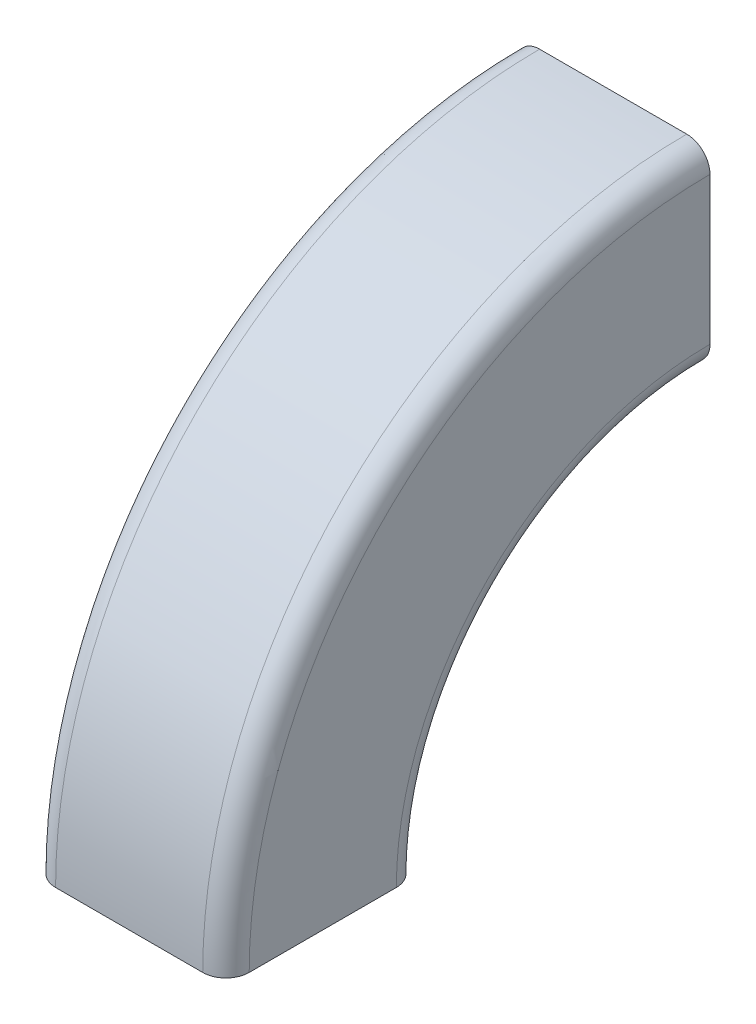
ISO-10303-21;
HEADER;
FILE_DESCRIPTION(('STEP AP214'),'2;1');
FILE_NAME('part.step','',(''),(''),'','','');
FILE_SCHEMA(('AUTOMOTIVE_DESIGN { 1 0 10303 214 1 1 1 1 }'));
ENDSEC;
DATA;
#1=APPLICATION_CONTEXT('core data for automotive mechanical design processes');
#2=APPLICATION_PROTOCOL_DEFINITION('international standard','automotive_design',2000,#1);
#3=PRODUCT_CONTEXT('',#1,'mechanical');
#4=PRODUCT('Part','Part','',(#3));
#5=PRODUCT_RELATED_PRODUCT_CATEGORY('part','',(#4));
#6=PRODUCT_DEFINITION_FORMATION('','',#4);
#7=PRODUCT_DEFINITION_CONTEXT('part definition',#1,'design');
#8=PRODUCT_DEFINITION('design','',#6,#7);
#9=PRODUCT_DEFINITION_SHAPE('','',#8);
#10=(LENGTH_UNIT() NAMED_UNIT(*) SI_UNIT(.MILLI.,.METRE.));
#11=(NAMED_UNIT(*) PLANE_ANGLE_UNIT() SI_UNIT($,.RADIAN.));
#12=(NAMED_UNIT(*) SI_UNIT($,.STERADIAN.) SOLID_ANGLE_UNIT());
#13=UNCERTAINTY_MEASURE_WITH_UNIT(LENGTH_MEASURE(1.E-05),#10,'distance_accuracy_value','');
#14=(GEOMETRIC_REPRESENTATION_CONTEXT(3) GLOBAL_UNCERTAINTY_ASSIGNED_CONTEXT((#13)) GLOBAL_UNIT_ASSIGNED_CONTEXT((#10,
#11,#12)) REPRESENTATION_CONTEXT('',''));
#15=CARTESIAN_POINT('',(0.,0.,0.));
#16=DIRECTION('',(0.,0.,1.));
#17=DIRECTION('',(1.,0.,0.));
#18=AXIS2_PLACEMENT_3D('',#15,#16,#17);
#19=CARTESIAN_POINT('',(0.,-49.9999999810388,50.));
#20=DIRECTION('',(0.,1.,-3.79222714511838E-10));
#21=DIRECTION('',(-0.999999999997454,0.,-2.25629999750851E-06));
#22=AXIS2_PLACEMENT_3D('',#19,#20,#21);
#23=PLANE('',#22);
#24=CARTESIAN_POINT('',(-9.5,-49.9999999846414,40.5));
#25=DIRECTION('',(0.,1.,-3.79222714511838E-10));
#26=DIRECTION('',(1.,0.,0.));
#27=AXIS2_PLACEMENT_3D('',#24,#25,#26);
#28=CIRCLE('',#27,3.);
#29=CARTESIAN_POINT('',(-9.5,-49.9999999857791,37.5));
#30=VERTEX_POINT('',#29);
#31=CARTESIAN_POINT('',(-12.5,-49.9999999846414,40.5));
#32=VERTEX_POINT('',#31);
#33=EDGE_CURVE('E26',#30,#32,#28,.T.);
#34=ORIENTED_EDGE('',*,*,#33,.F.);
#35=DIRECTION('',(-1.,0.,0.));
#36=VECTOR('',#35,1.);
#37=CARTESIAN_POINT('',(9.5,-49.9999999857791,37.5));
#38=LINE('',#37,#36);
#39=CARTESIAN_POINT('',(9.5,-49.9999999857791,37.5));
#40=VERTEX_POINT('',#39);
#41=EDGE_CURVE('E215',#40,#30,#38,.T.);
#42=ORIENTED_EDGE('',*,*,#41,.F.);
#43=CARTESIAN_POINT('',(9.5,-49.9999999846414,40.5));
#44=DIRECTION('',(0.,1.,-3.79222714511838E-10));
#45=DIRECTION('',(0.,3.79222714511838E-10,1.));
#46=AXIS2_PLACEMENT_3D('',#43,#44,#45);
#47=CIRCLE('',#46,3.);
#48=CARTESIAN_POINT('',(12.5,-49.9999999846414,40.5));
#49=VERTEX_POINT('',#48);
#50=EDGE_CURVE('E254',#49,#40,#47,.T.);
#51=ORIENTED_EDGE('',*,*,#50,.F.);
#52=DIRECTION('',(0.,-3.79222714511838E-10,-1.));
#53=VECTOR('',#52,1.);
#54=CARTESIAN_POINT('',(12.5,-49.9999999774362,59.5));
#55=LINE('',#54,#53);
#56=CARTESIAN_POINT('',(12.5,-49.9999999774362,59.5));
#57=VERTEX_POINT('',#56);
#58=EDGE_CURVE('E288',#57,#49,#55,.T.);
#59=ORIENTED_EDGE('',*,*,#58,.F.);
#60=CARTESIAN_POINT('',(9.5,-49.9999999774362,59.5));
#61=DIRECTION('',(0.,1.,-3.79222714511838E-10));
#62=DIRECTION('',(-1.,0.,0.));
#63=AXIS2_PLACEMENT_3D('',#60,#61,#62);
#64=CIRCLE('',#63,3.);
#65=CARTESIAN_POINT('',(9.5,-49.9999999762985,62.5));
#66=VERTEX_POINT('',#65);
#67=EDGE_CURVE('E188',#66,#57,#64,.T.);
#68=ORIENTED_EDGE('',*,*,#67,.F.);
#69=DIRECTION('',(1.,0.,0.));
#70=VECTOR('',#69,1.);
#71=CARTESIAN_POINT('',(-9.5,-49.9999999762985,62.5));
#72=LINE('',#71,#70);
#73=CARTESIAN_POINT('',(-9.5,-49.9999999762985,62.5));
#74=VERTEX_POINT('',#73);
#75=EDGE_CURVE('E181',#74,#66,#72,.T.);
#76=ORIENTED_EDGE('',*,*,#75,.F.);
#77=CARTESIAN_POINT('',(-9.5,-49.9999999774362,59.5));
#78=DIRECTION('',(0.,1.,-3.79222714511838E-10));
#79=DIRECTION('',(0.,-3.79222714511838E-10,-1.));
#80=AXIS2_PLACEMENT_3D('',#77,#78,#79);
#81=CIRCLE('',#80,3.);
#82=CARTESIAN_POINT('',(-12.5,-49.9999999774362,59.5));
#83=VERTEX_POINT('',#82);
#84=EDGE_CURVE('E165',#83,#74,#81,.T.);
#85=ORIENTED_EDGE('',*,*,#84,.F.);
#86=DIRECTION('',(0.,3.79222714511838E-10,1.));
#87=VECTOR('',#86,1.);
#88=CARTESIAN_POINT('',(-12.5,-49.9999999846414,40.5));
#89=LINE('',#88,#87);
#90=EDGE_CURVE('E151',#32,#83,#89,.T.);
#91=ORIENTED_EDGE('',*,*,#90,.F.);
#92=EDGE_LOOP('',(#34,#42,#51,#59,#68,#76,#85,#91));
#93=FACE_BOUND('',#92,.T.);
#94=DIRECTION('',(0.,3.79222714511838E-10,1.));
#95=VECTOR('',#94,1.);
#96=CARTESIAN_POINT('',(-10.5,-49.9999999828401,45.25));
#97=LINE('',#96,#95);
#98=CARTESIAN_POINT('',(-10.5,-49.9999999846414,40.5));
#99=VERTEX_POINT('',#98);
#100=CARTESIAN_POINT('',(-10.5,-49.9999999774362,59.5));
#101=VERTEX_POINT('',#100);
#102=EDGE_CURVE('E310',#99,#101,#97,.T.);
#103=ORIENTED_EDGE('',*,*,#102,.T.);
#104=CARTESIAN_POINT('',(-9.5,-49.9999999774362,59.5));
#105=DIRECTION('',(0.,1.,-3.79222714511838E-10));
#106=DIRECTION('',(0.,3.79222714511838E-10,1.));
#107=AXIS2_PLACEMENT_3D('',#104,#105,#106);
#108=CIRCLE('',#107,1.);
#109=CARTESIAN_POINT('',(-9.5,-49.999999977057,60.5));
#110=VERTEX_POINT('',#109);
#111=EDGE_CURVE('E208',#101,#110,#108,.T.);
#112=ORIENTED_EDGE('',*,*,#111,.T.);
#113=DIRECTION('',(1.,0.,0.));
#114=VECTOR('',#113,1.);
#115=CARTESIAN_POINT('',(0.,-49.999999977057,60.5));
#116=LINE('',#115,#114);
#117=CARTESIAN_POINT('',(9.5,-49.999999977057,60.5));
#118=VERTEX_POINT('',#117);
#119=EDGE_CURVE('E240',#110,#118,#116,.T.);
#120=ORIENTED_EDGE('',*,*,#119,.T.);
#121=CARTESIAN_POINT('',(9.5,-49.9999999774362,59.5));
#122=DIRECTION('',(0.,1.,-3.79222714511838E-10));
#123=DIRECTION('',(0.,3.79222714511838E-10,1.));
#124=AXIS2_PLACEMENT_3D('',#121,#122,#123);
#125=CIRCLE('',#124,1.);
#126=CARTESIAN_POINT('',(10.5,-49.9999999774362,59.5));
#127=VERTEX_POINT('',#126);
#128=EDGE_CURVE('E207',#118,#127,#125,.T.);
#129=ORIENTED_EDGE('',*,*,#128,.T.);
#130=DIRECTION('',(0.,-3.79222714511838E-10,-1.));
#131=VECTOR('',#130,1.);
#132=CARTESIAN_POINT('',(10.5,-49.9999999792375,54.75));
#133=LINE('',#132,#131);
#134=CARTESIAN_POINT('',(10.5,-49.9999999846414,40.5));
#135=VERTEX_POINT('',#134);
#136=EDGE_CURVE('E222',#127,#135,#133,.T.);
#137=ORIENTED_EDGE('',*,*,#136,.T.);
#138=CARTESIAN_POINT('',(9.5,-49.9999999846415,40.5));
#139=DIRECTION('',(0.,1.,-3.79222714511838E-10));
#140=DIRECTION('',(0.,3.79222714511838E-10,1.));
#141=AXIS2_PLACEMENT_3D('',#138,#139,#140);
#142=CIRCLE('',#141,1.);
#143=CARTESIAN_POINT('',(9.5,-49.9999999850207,39.5));
#144=VERTEX_POINT('',#143);
#145=EDGE_CURVE('E80',#135,#144,#142,.T.);
#146=ORIENTED_EDGE('',*,*,#145,.T.);
#147=DIRECTION('',(-1.,0.,0.));
#148=VECTOR('',#147,1.);
#149=CARTESIAN_POINT('',(0.,-49.9999999850207,39.5));
#150=LINE('',#149,#148);
#151=CARTESIAN_POINT('',(-9.5,-49.9999999850206,39.5));
#152=VERTEX_POINT('',#151);
#153=EDGE_CURVE('E269',#144,#152,#150,.T.);
#154=ORIENTED_EDGE('',*,*,#153,.T.);
#155=CARTESIAN_POINT('',(-9.5,-49.9999999846415,40.5));
#156=DIRECTION('',(0.,1.,-3.79222714511838E-10));
#157=DIRECTION('',(0.,3.79222714511838E-10,1.));
#158=AXIS2_PLACEMENT_3D('',#155,#156,#157);
#159=CIRCLE('',#158,1.);
#160=EDGE_CURVE('E235',#152,#99,#159,.T.);
#161=ORIENTED_EDGE('',*,*,#160,.T.);
#162=EDGE_LOOP('',(#103,#112,#120,#129,#137,#146,#154,#161));
#163=FACE_BOUND('',#162,.T.);
#164=ADVANCED_FACE('F16',(#93,#163),#23,.F.);
#165=CARTESIAN_POINT('',(0.,0.,0.));
#166=DIRECTION('',(0.,0.,-1.));
#167=DIRECTION('',(-1.,0.,0.));
#168=AXIS2_PLACEMENT_3D('',#165,#166,#167);
#169=PLANE('',#168);
#170=CARTESIAN_POINT('',(-9.5,-9.5,0.));
#171=DIRECTION('',(0.,0.,-1.));
#172=DIRECTION('',(1.,0.,0.));
#173=AXIS2_PLACEMENT_3D('',#170,#171,#172);
#174=CIRCLE('',#173,3.);
#175=CARTESIAN_POINT('',(-9.5,-12.5,0.));
#176=VERTEX_POINT('',#175);
#177=CARTESIAN_POINT('',(-12.5,-9.5,0.));
#178=VERTEX_POINT('',#177);
#179=EDGE_CURVE('E11',#176,#178,#174,.T.);
#180=ORIENTED_EDGE('',*,*,#179,.T.);
#181=DIRECTION('',(0.,1.,0.));
#182=VECTOR('',#181,1.);
#183=CARTESIAN_POINT('',(-12.5,-9.5,0.));
#184=LINE('',#183,#182);
#185=CARTESIAN_POINT('',(-12.5,9.5,0.));
#186=VERTEX_POINT('',#185);
#187=EDGE_CURVE('E139',#178,#186,#184,.T.);
#188=ORIENTED_EDGE('',*,*,#187,.T.);
#189=CARTESIAN_POINT('',(-9.5,9.5,0.));
#190=DIRECTION('',(0.,0.,-1.));
#191=DIRECTION('',(0.,-1.,0.));
#192=AXIS2_PLACEMENT_3D('',#189,#190,#191);
#193=CIRCLE('',#192,3.);
#194=CARTESIAN_POINT('',(-9.5,12.5,0.));
#195=VERTEX_POINT('',#194);
#196=EDGE_CURVE('E175',#186,#195,#193,.T.);
#197=ORIENTED_EDGE('',*,*,#196,.T.);
#198=DIRECTION('',(1.,0.,0.));
#199=VECTOR('',#198,1.);
#200=CARTESIAN_POINT('',(-9.5,12.5,0.));
#201=LINE('',#200,#199);
#202=CARTESIAN_POINT('',(9.5,12.5,0.));
#203=VERTEX_POINT('',#202);
#204=EDGE_CURVE('E183',#195,#203,#201,.T.);
#205=ORIENTED_EDGE('',*,*,#204,.T.);
#206=CARTESIAN_POINT('',(9.5,9.5,0.));
#207=DIRECTION('',(0.,0.,-1.));
#208=DIRECTION('',(-1.,0.,0.));
#209=AXIS2_PLACEMENT_3D('',#206,#207,#208);
#210=CIRCLE('',#209,3.);
#211=CARTESIAN_POINT('',(12.5,9.5,0.));
#212=VERTEX_POINT('',#211);
#213=EDGE_CURVE('E19',#203,#212,#210,.T.);
#214=ORIENTED_EDGE('',*,*,#213,.T.);
#215=DIRECTION('',(0.,-1.,0.));
#216=VECTOR('',#215,1.);
#217=CARTESIAN_POINT('',(12.5,9.5,0.));
#218=LINE('',#217,#216);
#219=CARTESIAN_POINT('',(12.5,-9.5,0.));
#220=VERTEX_POINT('',#219);
#221=EDGE_CURVE('E291',#212,#220,#218,.T.);
#222=ORIENTED_EDGE('',*,*,#221,.T.);
#223=CARTESIAN_POINT('',(9.5,-9.5,0.));
#224=DIRECTION('',(0.,0.,-1.));
#225=DIRECTION('',(0.,1.,0.));
#226=AXIS2_PLACEMENT_3D('',#223,#224,#225);
#227=CIRCLE('',#226,3.);
#228=CARTESIAN_POINT('',(9.5,-12.5,0.));
#229=VERTEX_POINT('',#228);
#230=EDGE_CURVE('E255',#220,#229,#227,.T.);
#231=ORIENTED_EDGE('',*,*,#230,.T.);
#232=DIRECTION('',(-1.,0.,0.));
#233=VECTOR('',#232,1.);
#234=CARTESIAN_POINT('',(9.5,-12.5,0.));
#235=LINE('',#234,#233);
#236=EDGE_CURVE('E249',#229,#176,#235,.T.);
#237=ORIENTED_EDGE('',*,*,#236,.T.);
#238=EDGE_LOOP('',(#180,#188,#197,#205,#214,#222,#231,#237));
#239=FACE_BOUND('',#238,.T.);
#240=DIRECTION('',(0.,-1.,0.));
#241=VECTOR('',#240,1.);
#242=CARTESIAN_POINT('',(-10.5,-24.9999999923207,0.));
#243=LINE('',#242,#241);
#244=CARTESIAN_POINT('',(-10.5,9.5,0.));
#245=VERTEX_POINT('',#244);
#246=CARTESIAN_POINT('',(-10.5,-9.5,0.));
#247=VERTEX_POINT('',#246);
#248=EDGE_CURVE('E297',#245,#247,#243,.T.);
#249=ORIENTED_EDGE('',*,*,#248,.T.);
#250=CARTESIAN_POINT('',(-9.5,-9.5,0.));
#251=DIRECTION('',(0.,0.,1.));
#252=DIRECTION('',(0.,1.,0.));
#253=AXIS2_PLACEMENT_3D('',#250,#251,#252);
#254=CIRCLE('',#253,1.);
#255=CARTESIAN_POINT('',(-9.5,-10.5,0.));
#256=VERTEX_POINT('',#255);
#257=EDGE_CURVE('E284',#247,#256,#254,.T.);
#258=ORIENTED_EDGE('',*,*,#257,.T.);
#259=DIRECTION('',(1.,0.,0.));
#260=VECTOR('',#259,1.);
#261=CARTESIAN_POINT('',(0.,-10.5,0.));
#262=LINE('',#261,#260);
#263=CARTESIAN_POINT('',(9.5,-10.5,0.));
#264=VERTEX_POINT('',#263);
#265=EDGE_CURVE('E268',#256,#264,#262,.T.);
#266=ORIENTED_EDGE('',*,*,#265,.T.);
#267=CARTESIAN_POINT('',(9.5,-9.5,0.));
#268=DIRECTION('',(0.,0.,1.));
#269=DIRECTION('',(0.,1.,0.));
#270=AXIS2_PLACEMENT_3D('',#267,#268,#269);
#271=CIRCLE('',#270,1.);
#272=CARTESIAN_POINT('',(10.5,-9.5,0.));
#273=VERTEX_POINT('',#272);
#274=EDGE_CURVE('E92',#264,#273,#271,.T.);
#275=ORIENTED_EDGE('',*,*,#274,.T.);
#276=DIRECTION('',(0.,1.,0.));
#277=VECTOR('',#276,1.);
#278=CARTESIAN_POINT('',(10.5,-24.9999999887181,0.));
#279=LINE('',#278,#277);
#280=CARTESIAN_POINT('',(10.5,9.5,0.));
#281=VERTEX_POINT('',#280);
#282=EDGE_CURVE('E217',#273,#281,#279,.T.);
#283=ORIENTED_EDGE('',*,*,#282,.T.);
#284=CARTESIAN_POINT('',(9.5,9.5,0.));
#285=DIRECTION('',(0.,0.,1.));
#286=DIRECTION('',(0.,1.,0.));
#287=AXIS2_PLACEMENT_3D('',#284,#285,#286);
#288=CIRCLE('',#287,1.);
#289=CARTESIAN_POINT('',(9.5,10.5,0.));
#290=VERTEX_POINT('',#289);
#291=EDGE_CURVE('E201',#281,#290,#288,.T.);
#292=ORIENTED_EDGE('',*,*,#291,.T.);
#293=DIRECTION('',(-1.,0.,0.));
#294=VECTOR('',#293,1.);
#295=CARTESIAN_POINT('',(0.,10.5,0.));
#296=LINE('',#295,#294);
#297=CARTESIAN_POINT('',(-9.5,10.5,0.));
#298=VERTEX_POINT('',#297);
#299=EDGE_CURVE('E213',#290,#298,#296,.T.);
#300=ORIENTED_EDGE('',*,*,#299,.T.);
#301=CARTESIAN_POINT('',(-9.5,9.5,0.));
#302=DIRECTION('',(0.,0.,1.));
#303=DIRECTION('',(0.,1.,0.));
#304=AXIS2_PLACEMENT_3D('',#301,#302,#303);
#305=CIRCLE('',#304,1.);
#306=EDGE_CURVE('E212',#298,#245,#305,.T.);
#307=ORIENTED_EDGE('',*,*,#306,.T.);
#308=EDGE_LOOP('',(#249,#258,#266,#275,#283,#292,#300,#307));
#309=FACE_BOUND('',#308,.T.);
#310=ADVANCED_FACE('F324',(#239,#309),#169,.T.);
#311=CARTESIAN_POINT('',(-9.5,-50.,0.));
#312=DIRECTION('',(-1.,0.,0.));
#313=DIRECTION('',(0.,0.,1.));
#314=AXIS2_PLACEMENT_3D('',#311,#312,#313);
#315=TOROIDAL_SURFACE('',#314,40.5,3.);
#316=ORIENTED_EDGE('',*,*,#33,.T.);
#317=CARTESIAN_POINT('',(-12.5,-50.,0.));
#318=DIRECTION('',(-1.,0.,0.));
#319=DIRECTION('',(0.,3.79224552994452E-10,1.));
#320=AXIS2_PLACEMENT_3D('',#317,#318,#319);
#321=CIRCLE('',#320,40.5);
#322=EDGE_CURVE('E231',#32,#178,#321,.T.);
#323=ORIENTED_EDGE('',*,*,#322,.T.);
#324=ORIENTED_EDGE('',*,*,#179,.F.);
#325=CARTESIAN_POINT('',(-9.5,-50.,0.));
#326=DIRECTION('',(-1.,0.,0.));
#327=DIRECTION('',(0.,3.79223763502523E-10,1.));
#328=AXIS2_PLACEMENT_3D('',#325,#326,#327);
#329=CIRCLE('',#328,37.5);
#330=EDGE_CURVE('E245',#30,#176,#329,.T.);
#331=ORIENTED_EDGE('',*,*,#330,.F.);
#332=EDGE_LOOP('',(#316,#323,#324,#331));
#333=FACE_BOUND('',#332,.T.);
#334=ADVANCED_FACE('F408',(#333),#315,.T.);
#335=CARTESIAN_POINT('',(-12.5,-49.9999999846414,40.5));
#336=DIRECTION('',(-1.,0.,0.));
#337=DIRECTION('',(0.,1.,0.));
#338=AXIS2_PLACEMENT_3D('',#335,#336,#337);
#339=PLANE('',#338);
#340=ORIENTED_EDGE('',*,*,#90,.T.);
#341=CARTESIAN_POINT('',(-12.5,-50.,0.));
#342=DIRECTION('',(-1.,0.,0.));
#343=DIRECTION('',(0.,3.79223524664629E-10,1.));
#344=AXIS2_PLACEMENT_3D('',#341,#342,#343);
#345=CIRCLE('',#344,59.5);
#346=EDGE_CURVE('E171',#83,#186,#345,.T.);
#347=ORIENTED_EDGE('',*,*,#346,.T.);
#348=ORIENTED_EDGE('',*,*,#187,.F.);
#349=ORIENTED_EDGE('',*,*,#322,.F.);
#350=EDGE_LOOP('',(#340,#347,#348,#349));
#351=FACE_BOUND('',#350,.T.);
#352=ADVANCED_FACE('F413',(#351),#339,.T.);
#353=CARTESIAN_POINT('',(-9.5,-50.,0.));
#354=DIRECTION('',(-1.,0.,0.));
#355=DIRECTION('',(0.,0.,1.));
#356=AXIS2_PLACEMENT_3D('',#353,#354,#355);
#357=TOROIDAL_SURFACE('',#356,59.5,3.);
#358=ORIENTED_EDGE('',*,*,#84,.T.);
#359=CARTESIAN_POINT('',(-9.5,-50.,0.));
#360=DIRECTION('',(-1.,0.,0.));
#361=DIRECTION('',(0.,3.79223195068335E-10,1.));
#362=AXIS2_PLACEMENT_3D('',#359,#360,#361);
#363=CIRCLE('',#362,62.5);
#364=EDGE_CURVE('E169',#74,#195,#363,.T.);
#365=ORIENTED_EDGE('',*,*,#364,.T.);
#366=ORIENTED_EDGE('',*,*,#196,.F.);
#367=ORIENTED_EDGE('',*,*,#346,.F.);
#368=EDGE_LOOP('',(#358,#365,#366,#367));
#369=FACE_BOUND('',#368,.T.);
#370=ADVANCED_FACE('F167',(#369),#357,.T.);
#371=CARTESIAN_POINT('',(0.,-50.,0.));
#372=DIRECTION('',(-1.,0.,0.));
#373=DIRECTION('',(0.,3.79223408231155E-10,1.));
#374=AXIS2_PLACEMENT_3D('',#371,#372,#373);
#375=CYLINDRICAL_SURFACE('',#374,62.5);
#376=ORIENTED_EDGE('',*,*,#75,.T.);
#377=CARTESIAN_POINT('',(9.5,-50.,0.));
#378=DIRECTION('',(-1.,0.,0.));
#379=DIRECTION('',(0.,3.79223337176882E-10,1.));
#380=AXIS2_PLACEMENT_3D('',#377,#378,#379);
#381=CIRCLE('',#380,62.5);
#382=EDGE_CURVE('E190',#66,#203,#381,.T.);
#383=ORIENTED_EDGE('',*,*,#382,.T.);
#384=ORIENTED_EDGE('',*,*,#204,.F.);
#385=ORIENTED_EDGE('',*,*,#364,.F.);
#386=EDGE_LOOP('',(#376,#383,#384,#385));
#387=FACE_BOUND('',#386,.T.);
#388=ADVANCED_FACE('F179',(#387),#375,.T.);
#389=CARTESIAN_POINT('',(9.5,-50.,0.));
#390=DIRECTION('',(-1.,0.,0.));
#391=DIRECTION('',(0.,0.,1.));
#392=AXIS2_PLACEMENT_3D('',#389,#390,#391);
#393=TOROIDAL_SURFACE('',#392,59.5,3.);
#394=ORIENTED_EDGE('',*,*,#67,.T.);
#395=CARTESIAN_POINT('',(12.5,-50.,0.));
#396=DIRECTION('',(-1.,0.,0.));
#397=DIRECTION('',(0.,3.79223226117261E-10,1.));
#398=AXIS2_PLACEMENT_3D('',#395,#396,#397);
#399=CIRCLE('',#398,59.5);
#400=EDGE_CURVE('E261',#57,#212,#399,.T.);
#401=ORIENTED_EDGE('',*,*,#400,.T.);
#402=ORIENTED_EDGE('',*,*,#213,.F.);
#403=ORIENTED_EDGE('',*,*,#382,.F.);
#404=EDGE_LOOP('',(#394,#401,#402,#403));
#405=FACE_BOUND('',#404,.T.);
#406=ADVANCED_FACE('F319',(#405),#393,.T.);
#407=CARTESIAN_POINT('',(12.5,-49.9999999774362,59.5));
#408=DIRECTION('',(1.,0.,0.));
#409=DIRECTION('',(0.,0.,-1.));
#410=AXIS2_PLACEMENT_3D('',#407,#408,#409);
#411=PLANE('',#410);
#412=ORIENTED_EDGE('',*,*,#58,.T.);
#413=CARTESIAN_POINT('',(12.5,-50.,0.));
#414=DIRECTION('',(-1.,0.,0.));
#415=DIRECTION('',(0.,3.79223237174571E-10,1.));
#416=AXIS2_PLACEMENT_3D('',#413,#414,#415);
#417=CIRCLE('',#416,40.5);
#418=EDGE_CURVE('E258',#49,#220,#417,.T.);
#419=ORIENTED_EDGE('',*,*,#418,.T.);
#420=ORIENTED_EDGE('',*,*,#221,.F.);
#421=ORIENTED_EDGE('',*,*,#400,.F.);
#422=EDGE_LOOP('',(#412,#419,#420,#421));
#423=FACE_BOUND('',#422,.T.);
#424=ADVANCED_FACE('F321',(#423),#411,.T.);
#425=CARTESIAN_POINT('',(9.5,-50.,0.));
#426=DIRECTION('',(-1.,0.,0.));
#427=DIRECTION('',(0.,0.,1.));
#428=AXIS2_PLACEMENT_3D('',#425,#426,#427);
#429=TOROIDAL_SURFACE('',#428,40.5,3.);
#430=ORIENTED_EDGE('',*,*,#50,.T.);
#431=CARTESIAN_POINT('',(9.5,-50.,0.));
#432=DIRECTION('',(-1.,0.,0.));
#433=DIRECTION('',(0.,3.79224000350102E-10,1.));
#434=AXIS2_PLACEMENT_3D('',#431,#432,#433);
#435=CIRCLE('',#434,37.5);
#436=EDGE_CURVE('E250',#40,#229,#435,.T.);
#437=ORIENTED_EDGE('',*,*,#436,.T.);
#438=ORIENTED_EDGE('',*,*,#230,.F.);
#439=ORIENTED_EDGE('',*,*,#418,.F.);
#440=EDGE_LOOP('',(#430,#437,#438,#439));
#441=FACE_BOUND('',#440,.T.);
#442=ADVANCED_FACE('F446',(#441),#429,.T.);
#443=CARTESIAN_POINT('',(0.,-50.,0.));
#444=DIRECTION('',(-1.,0.,0.));
#445=DIRECTION('',(0.,3.79223408231155E-10,1.));
#446=AXIS2_PLACEMENT_3D('',#443,#444,#445);
#447=CYLINDRICAL_SURFACE('',#446,37.5);
#448=ORIENTED_EDGE('',*,*,#41,.T.);
#449=ORIENTED_EDGE('',*,*,#330,.T.);
#450=ORIENTED_EDGE('',*,*,#236,.F.);
#451=ORIENTED_EDGE('',*,*,#436,.F.);
#452=EDGE_LOOP('',(#448,#449,#450,#451));
#453=FACE_BOUND('',#452,.T.);
#454=ADVANCED_FACE('F453',(#453),#447,.F.);
#455=CARTESIAN_POINT('',(-9.5,-50.,0.));
#456=DIRECTION('',(-1.,0.,0.));
#457=DIRECTION('',(0.,0.,1.));
#458=AXIS2_PLACEMENT_3D('',#455,#456,#457);
#459=TOROIDAL_SURFACE('',#458,59.5,1.);
#460=ORIENTED_EDGE('',*,*,#111,.F.);
#461=CARTESIAN_POINT('',(-10.5,-50.,0.));
#462=DIRECTION('',(-1.,0.,0.));
#463=DIRECTION('',(0.,3.79223375390945E-10,1.));
#464=AXIS2_PLACEMENT_3D('',#461,#462,#463);
#465=CIRCLE('',#464,59.5);
#466=EDGE_CURVE('E239',#101,#245,#465,.T.);
#467=ORIENTED_EDGE('',*,*,#466,.T.);
#468=ORIENTED_EDGE('',*,*,#306,.F.);
#469=CARTESIAN_POINT('',(-9.5,-50.,0.));
#470=DIRECTION('',(-1.,0.,0.));
#471=DIRECTION('',(0.,3.79223704779983E-10,1.));
#472=AXIS2_PLACEMENT_3D('',#469,#470,#471);
#473=CIRCLE('',#472,60.5);
#474=EDGE_CURVE('E244',#110,#298,#473,.T.);
#475=ORIENTED_EDGE('',*,*,#474,.F.);
#476=EDGE_LOOP('',(#460,#467,#468,#475));
#477=FACE_BOUND('',#476,.T.);
#478=ADVANCED_FACE('F374',(#477),#459,.F.);
#479=CARTESIAN_POINT('',(0.,-50.,0.));
#480=DIRECTION('',(-1.,0.,0.));
#481=DIRECTION('',(0.,3.79223408231155E-10,1.));
#482=AXIS2_PLACEMENT_3D('',#479,#480,#481);
#483=CYLINDRICAL_SURFACE('',#482,60.5);
#484=ORIENTED_EDGE('',*,*,#119,.F.);
#485=ORIENTED_EDGE('',*,*,#474,.T.);
#486=ORIENTED_EDGE('',*,*,#299,.F.);
#487=CARTESIAN_POINT('',(9.5,-50.,0.));
#488=DIRECTION('',(-1.,0.,0.));
#489=DIRECTION('',(0.,3.79223411167282E-10,1.));
#490=AXIS2_PLACEMENT_3D('',#487,#488,#489);
#491=CIRCLE('',#490,60.5);
#492=EDGE_CURVE('E203',#118,#290,#491,.T.);
#493=ORIENTED_EDGE('',*,*,#492,.F.);
#494=EDGE_LOOP('',(#484,#485,#486,#493));
#495=FACE_BOUND('',#494,.T.);
#496=ADVANCED_FACE('F345',(#495),#483,.F.);
#497=CARTESIAN_POINT('',(9.5,-50.,0.));
#498=DIRECTION('',(-1.,0.,0.));
#499=DIRECTION('',(0.,0.,1.));
#500=AXIS2_PLACEMENT_3D('',#497,#498,#499);
#501=TOROIDAL_SURFACE('',#500,59.5,1.);
#502=ORIENTED_EDGE('',*,*,#128,.F.);
#503=ORIENTED_EDGE('',*,*,#492,.T.);
#504=ORIENTED_EDGE('',*,*,#291,.F.);
#505=CARTESIAN_POINT('',(10.5,-50.,0.));
#506=DIRECTION('',(-1.,0.,0.));
#507=DIRECTION('',(0.,3.79223375390945E-10,1.));
#508=AXIS2_PLACEMENT_3D('',#505,#506,#507);
#509=CIRCLE('',#508,59.5);
#510=EDGE_CURVE('E221',#127,#281,#509,.T.);
#511=ORIENTED_EDGE('',*,*,#510,.F.);
#512=EDGE_LOOP('',(#502,#503,#504,#511));
#513=FACE_BOUND('',#512,.T.);
#514=ADVANCED_FACE('F346',(#513),#501,.F.);
#515=CARTESIAN_POINT('',(10.5,-49.9999999774362,59.5));
#516=DIRECTION('',(1.,0.,0.));
#517=DIRECTION('',(0.,0.,-1.));
#518=AXIS2_PLACEMENT_3D('',#515,#516,#517);
#519=PLANE('',#518);
#520=ORIENTED_EDGE('',*,*,#136,.F.);
#521=ORIENTED_EDGE('',*,*,#510,.T.);
#522=ORIENTED_EDGE('',*,*,#282,.F.);
#523=CARTESIAN_POINT('',(10.5,-50.,0.));
#524=DIRECTION('',(-1.,0.,0.));
#525=DIRECTION('',(0.,3.79223895084511E-10,1.));
#526=AXIS2_PLACEMENT_3D('',#523,#524,#525);
#527=CIRCLE('',#526,40.5);
#528=EDGE_CURVE('E232',#135,#273,#527,.T.);
#529=ORIENTED_EDGE('',*,*,#528,.F.);
#530=EDGE_LOOP('',(#520,#521,#522,#529));
#531=FACE_BOUND('',#530,.T.);
#532=ADVANCED_FACE('F425',(#531),#519,.F.);
#533=CARTESIAN_POINT('',(9.5,-50.,0.));
#534=DIRECTION('',(-1.,0.,0.));
#535=DIRECTION('',(0.,0.,1.));
#536=AXIS2_PLACEMENT_3D('',#533,#534,#535);
#537=TOROIDAL_SURFACE('',#536,40.5,1.);
#538=ORIENTED_EDGE('',*,*,#145,.F.);
#539=ORIENTED_EDGE('',*,*,#528,.T.);
#540=ORIENTED_EDGE('',*,*,#274,.F.);
#541=CARTESIAN_POINT('',(9.5,-50.,0.));
#542=DIRECTION('',(-1.,0.,0.));
#543=DIRECTION('',(0.,3.79223853444642E-10,1.));
#544=AXIS2_PLACEMENT_3D('',#541,#542,#543);
#545=CIRCLE('',#544,39.5);
#546=EDGE_CURVE('E265',#144,#264,#545,.T.);
#547=ORIENTED_EDGE('',*,*,#546,.F.);
#548=EDGE_LOOP('',(#538,#539,#540,#547));
#549=FACE_BOUND('',#548,.T.);
#550=ADVANCED_FACE('F400',(#549),#537,.F.);
#551=CARTESIAN_POINT('',(0.,-50.,0.));
#552=DIRECTION('',(-1.,0.,0.));
#553=DIRECTION('',(0.,3.79223408231155E-10,1.));
#554=AXIS2_PLACEMENT_3D('',#551,#552,#553);
#555=CYLINDRICAL_SURFACE('',#554,39.5);
#556=ORIENTED_EDGE('',*,*,#153,.F.);
#557=ORIENTED_EDGE('',*,*,#546,.T.);
#558=ORIENTED_EDGE('',*,*,#265,.F.);
#559=CARTESIAN_POINT('',(-9.5,-50.,0.));
#560=DIRECTION('',(-1.,0.,0.));
#561=DIRECTION('',(0.,3.79224303155234E-10,1.));
#562=AXIS2_PLACEMENT_3D('',#559,#560,#561);
#563=CIRCLE('',#562,39.5);
#564=EDGE_CURVE('E238',#152,#256,#563,.T.);
#565=ORIENTED_EDGE('',*,*,#564,.F.);
#566=EDGE_LOOP('',(#556,#557,#558,#565));
#567=FACE_BOUND('',#566,.T.);
#568=ADVANCED_FACE('F389',(#567),#555,.T.);
#569=CARTESIAN_POINT('',(-9.5,-50.,0.));
#570=DIRECTION('',(-1.,0.,0.));
#571=DIRECTION('',(0.,0.,1.));
#572=AXIS2_PLACEMENT_3D('',#569,#570,#571);
#573=TOROIDAL_SURFACE('',#572,40.5,1.);
#574=ORIENTED_EDGE('',*,*,#160,.F.);
#575=ORIENTED_EDGE('',*,*,#564,.T.);
#576=ORIENTED_EDGE('',*,*,#257,.F.);
#577=CARTESIAN_POINT('',(-10.5,-50.,0.));
#578=DIRECTION('',(-1.,0.,0.));
#579=DIRECTION('',(0.,3.79224552994452E-10,1.));
#580=AXIS2_PLACEMENT_3D('',#577,#578,#579);
#581=CIRCLE('',#580,40.5);
#582=EDGE_CURVE('E301',#99,#247,#581,.T.);
#583=ORIENTED_EDGE('',*,*,#582,.F.);
#584=EDGE_LOOP('',(#574,#575,#576,#583));
#585=FACE_BOUND('',#584,.T.);
#586=ADVANCED_FACE('F391',(#585),#573,.F.);
#587=CARTESIAN_POINT('',(-10.5,-49.9999999846414,40.5));
#588=DIRECTION('',(-1.,0.,0.));
#589=DIRECTION('',(0.,1.,0.));
#590=AXIS2_PLACEMENT_3D('',#587,#588,#589);
#591=PLANE('',#590);
#592=ORIENTED_EDGE('',*,*,#102,.F.);
#593=ORIENTED_EDGE('',*,*,#582,.T.);
#594=ORIENTED_EDGE('',*,*,#248,.F.);
#595=ORIENTED_EDGE('',*,*,#466,.F.);
#596=EDGE_LOOP('',(#592,#593,#594,#595));
#597=FACE_BOUND('',#596,.T.);
#598=ADVANCED_FACE('F377',(#597),#591,.F.);
#599=CLOSED_SHELL('',(#164,#310,#334,#352,#370,#388,#406,#424,#442,#454,#478,#496,#514,#532,
#550,#568,#586,#598));
#600=MANIFOLD_SOLID_BREP('B1',#599);
#601=ADVANCED_BREP_SHAPE_REPRESENTATION('',(#18,#600),#14);
#602=SHAPE_DEFINITION_REPRESENTATION(#9,#601);
ENDSEC;
END-ISO-10303-21;
